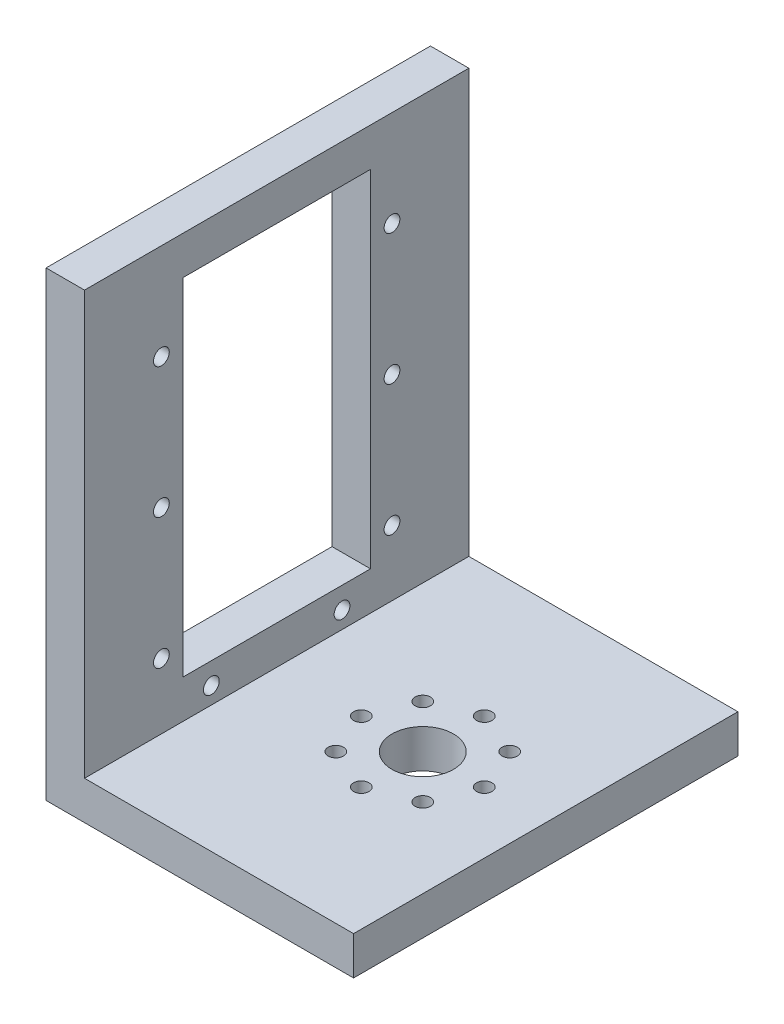
ISO-10303-21;
HEADER;
FILE_DESCRIPTION(('STEP AP214'),'2;1');
FILE_NAME('part.step','',(''),(''),'','','');
FILE_SCHEMA(('AUTOMOTIVE_DESIGN { 1 0 10303 214 1 1 1 1 }'));
ENDSEC;
DATA;
#1=APPLICATION_CONTEXT('core data for automotive mechanical design processes');
#2=APPLICATION_PROTOCOL_DEFINITION('international standard','automotive_design',2000,#1);
#3=PRODUCT_CONTEXT('',#1,'mechanical');
#4=PRODUCT('Part','Part','',(#3));
#5=PRODUCT_RELATED_PRODUCT_CATEGORY('part','',(#4));
#6=PRODUCT_DEFINITION_FORMATION('','',#4);
#7=PRODUCT_DEFINITION_CONTEXT('part definition',#1,'design');
#8=PRODUCT_DEFINITION('design','',#6,#7);
#9=PRODUCT_DEFINITION_SHAPE('','',#8);
#10=(LENGTH_UNIT() NAMED_UNIT(*) SI_UNIT(.MILLI.,.METRE.));
#11=(NAMED_UNIT(*) PLANE_ANGLE_UNIT() SI_UNIT($,.RADIAN.));
#12=(NAMED_UNIT(*) SI_UNIT($,.STERADIAN.) SOLID_ANGLE_UNIT());
#13=UNCERTAINTY_MEASURE_WITH_UNIT(LENGTH_MEASURE(1.E-05),#10,'distance_accuracy_value','');
#14=(GEOMETRIC_REPRESENTATION_CONTEXT(3) GLOBAL_UNCERTAINTY_ASSIGNED_CONTEXT((#13)) GLOBAL_UNIT_ASSIGNED_CONTEXT((#10,
#11,#12)) REPRESENTATION_CONTEXT('',''));
#15=CARTESIAN_POINT('',(0.,0.,0.));
#16=DIRECTION('',(0.,0.,1.));
#17=DIRECTION('',(1.,0.,0.));
#18=AXIS2_PLACEMENT_3D('',#15,#16,#17);
#19=CARTESIAN_POINT('',(0.,5.,0.));
#20=DIRECTION('',(0.,-1.,0.));
#21=DIRECTION('',(0.,0.,-1.));
#22=AXIS2_PLACEMENT_3D('',#19,#20,#21);
#23=PLANE('',#22);
#24=CARTESIAN_POINT('',(18.3431457505076,5.,-30.6568542494924));
#25=DIRECTION('',(0.,1.,0.));
#26=DIRECTION('',(0.,0.,1.));
#27=AXIS2_PLACEMENT_3D('',#24,#25,#26);
#28=CIRCLE('',#27,0.999999999999998);
#29=CARTESIAN_POINT('',(18.3431457505076,5.,-29.6568542494924));
#30=VERTEX_POINT('',#29);
#31=EDGE_CURVE('E168',#30,#30,#28,.T.);
#32=ORIENTED_EDGE('',*,*,#31,.F.);
#33=EDGE_LOOP('',(#32));
#34=FACE_BOUND('',#33,.T.);
#35=CARTESIAN_POINT('',(16.,5.,-25.));
#36=DIRECTION('',(0.,1.,0.));
#37=DIRECTION('',(0.,0.,1.));
#38=AXIS2_PLACEMENT_3D('',#35,#36,#37);
#39=CIRCLE('',#38,0.999999999999998);
#40=CARTESIAN_POINT('',(16.,5.,-24.));
#41=VERTEX_POINT('',#40);
#42=EDGE_CURVE('E174',#41,#41,#39,.T.);
#43=ORIENTED_EDGE('',*,*,#42,.F.);
#44=EDGE_LOOP('',(#43));
#45=FACE_BOUND('',#44,.T.);
#46=CARTESIAN_POINT('',(18.3431457505076,5.,-19.3431457505076));
#47=DIRECTION('',(0.,1.,0.));
#48=DIRECTION('',(0.,0.,1.));
#49=AXIS2_PLACEMENT_3D('',#46,#47,#48);
#50=CIRCLE('',#49,0.999999999999998);
#51=CARTESIAN_POINT('',(18.3431457505076,5.,-18.3431457505076));
#52=VERTEX_POINT('',#51);
#53=EDGE_CURVE('E180',#52,#52,#50,.T.);
#54=ORIENTED_EDGE('',*,*,#53,.F.);
#55=EDGE_LOOP('',(#54));
#56=FACE_BOUND('',#55,.T.);
#57=CARTESIAN_POINT('',(24.,5.,-17.));
#58=DIRECTION('',(0.,1.,0.));
#59=DIRECTION('',(0.,0.,1.));
#60=AXIS2_PLACEMENT_3D('',#57,#58,#59);
#61=CIRCLE('',#60,0.999999999999998);
#62=CARTESIAN_POINT('',(24.,5.,-16.));
#63=VERTEX_POINT('',#62);
#64=EDGE_CURVE('E186',#63,#63,#61,.T.);
#65=ORIENTED_EDGE('',*,*,#64,.F.);
#66=EDGE_LOOP('',(#65));
#67=FACE_BOUND('',#66,.T.);
#68=CARTESIAN_POINT('',(29.6568542494924,5.,-19.3431457505076));
#69=DIRECTION('',(0.,1.,0.));
#70=DIRECTION('',(0.,0.,1.));
#71=AXIS2_PLACEMENT_3D('',#68,#69,#70);
#72=CIRCLE('',#71,0.999999999999998);
#73=CARTESIAN_POINT('',(29.6568542494924,5.,-18.3431457505076));
#74=VERTEX_POINT('',#73);
#75=EDGE_CURVE('E192',#74,#74,#72,.T.);
#76=ORIENTED_EDGE('',*,*,#75,.F.);
#77=EDGE_LOOP('',(#76));
#78=FACE_BOUND('',#77,.T.);
#79=CARTESIAN_POINT('',(32.,5.,-25.));
#80=DIRECTION('',(0.,1.,0.));
#81=DIRECTION('',(0.,0.,1.));
#82=AXIS2_PLACEMENT_3D('',#79,#80,#81);
#83=CIRCLE('',#82,0.999999999999998);
#84=CARTESIAN_POINT('',(32.,5.,-24.));
#85=VERTEX_POINT('',#84);
#86=EDGE_CURVE('E198',#85,#85,#83,.T.);
#87=ORIENTED_EDGE('',*,*,#86,.F.);
#88=EDGE_LOOP('',(#87));
#89=FACE_BOUND('',#88,.T.);
#90=CARTESIAN_POINT('',(29.6568542494924,5.,-30.6568542494924));
#91=DIRECTION('',(0.,1.,0.));
#92=DIRECTION('',(0.,0.,1.));
#93=AXIS2_PLACEMENT_3D('',#90,#91,#92);
#94=CIRCLE('',#93,0.999999999999998);
#95=CARTESIAN_POINT('',(29.6568542494924,5.,-29.6568542494924));
#96=VERTEX_POINT('',#95);
#97=EDGE_CURVE('E204',#96,#96,#94,.T.);
#98=ORIENTED_EDGE('',*,*,#97,.F.);
#99=EDGE_LOOP('',(#98));
#100=FACE_BOUND('',#99,.T.);
#101=CARTESIAN_POINT('',(24.,5.,-33.));
#102=DIRECTION('',(0.,1.,0.));
#103=DIRECTION('',(0.,0.,1.));
#104=AXIS2_PLACEMENT_3D('',#101,#102,#103);
#105=CIRCLE('',#104,0.999999999999998);
#106=CARTESIAN_POINT('',(24.,5.,-32.));
#107=VERTEX_POINT('',#106);
#108=EDGE_CURVE('E210',#107,#107,#105,.T.);
#109=ORIENTED_EDGE('',*,*,#108,.F.);
#110=EDGE_LOOP('',(#109));
#111=FACE_BOUND('',#110,.T.);
#112=CARTESIAN_POINT('',(24.,5.,-25.));
#113=DIRECTION('',(0.,1.,0.));
#114=DIRECTION('',(0.,0.,1.));
#115=AXIS2_PLACEMENT_3D('',#112,#113,#114);
#116=CIRCLE('',#115,4.);
#117=CARTESIAN_POINT('',(24.,5.,-21.));
#118=VERTEX_POINT('',#117);
#119=EDGE_CURVE('E216',#118,#118,#116,.T.);
#120=ORIENTED_EDGE('',*,*,#119,.F.);
#121=EDGE_LOOP('',(#120));
#122=FACE_BOUND('',#121,.T.);
#123=DIRECTION('',(0.,0.,-1.));
#124=VECTOR('',#123,1.);
#125=CARTESIAN_POINT('',(5.,5.,0.));
#126=LINE('',#125,#124);
#127=CARTESIAN_POINT('',(5.,5.,0.));
#128=VERTEX_POINT('',#127);
#129=CARTESIAN_POINT('',(5.,5.,-50.));
#130=VERTEX_POINT('',#129);
#131=EDGE_CURVE('E164',#128,#130,#126,.T.);
#132=ORIENTED_EDGE('',*,*,#131,.F.);
#133=DIRECTION('',(1.,0.,0.));
#134=VECTOR('',#133,1.);
#135=CARTESIAN_POINT('',(0.,5.,0.));
#136=LINE('',#135,#134);
#137=CARTESIAN_POINT('',(40.,5.,0.));
#138=VERTEX_POINT('',#137);
#139=EDGE_CURVE('E222',#128,#138,#136,.T.);
#140=ORIENTED_EDGE('',*,*,#139,.T.);
#141=DIRECTION('',(0.,0.,-1.));
#142=VECTOR('',#141,1.);
#143=CARTESIAN_POINT('',(40.,5.,0.));
#144=LINE('',#143,#142);
#145=CARTESIAN_POINT('',(40.,5.,-50.));
#146=VERTEX_POINT('',#145);
#147=EDGE_CURVE('E224',#138,#146,#144,.T.);
#148=ORIENTED_EDGE('',*,*,#147,.T.);
#149=DIRECTION('',(-1.,0.,0.));
#150=VECTOR('',#149,1.);
#151=CARTESIAN_POINT('',(0.,5.,-50.));
#152=LINE('',#151,#150);
#153=EDGE_CURVE('E227',#146,#130,#152,.T.);
#154=ORIENTED_EDGE('',*,*,#153,.T.);
#155=EDGE_LOOP('',(#132,#140,#148,#154));
#156=FACE_BOUND('',#155,.T.);
#157=ADVANCED_FACE('F41',(#34,#45,#56,#67,#78,#89,#100,#111,#122,#156),#23,.F.);
#158=CARTESIAN_POINT('',(0.,0.,0.));
#159=DIRECTION('',(0.,-1.,0.));
#160=DIRECTION('',(0.,0.,-1.));
#161=AXIS2_PLACEMENT_3D('',#158,#159,#160);
#162=PLANE('',#161);
#163=DIRECTION('',(0.,0.,1.));
#164=VECTOR('',#163,1.);
#165=CARTESIAN_POINT('',(0.,0.,0.));
#166=LINE('',#165,#164);
#167=CARTESIAN_POINT('',(0.,0.,-50.));
#168=VERTEX_POINT('',#167);
#169=CARTESIAN_POINT('',(0.,0.,0.));
#170=VERTEX_POINT('',#169);
#171=EDGE_CURVE('E219',#168,#170,#166,.T.);
#172=ORIENTED_EDGE('',*,*,#171,.F.);
#173=DIRECTION('',(-1.,0.,0.));
#174=VECTOR('',#173,1.);
#175=CARTESIAN_POINT('',(0.,0.,-50.));
#176=LINE('',#175,#174);
#177=CARTESIAN_POINT('',(40.,0.,-50.));
#178=VERTEX_POINT('',#177);
#179=EDGE_CURVE('E225',#178,#168,#176,.T.);
#180=ORIENTED_EDGE('',*,*,#179,.F.);
#181=DIRECTION('',(0.,0.,-1.));
#182=VECTOR('',#181,1.);
#183=CARTESIAN_POINT('',(40.,0.,0.));
#184=LINE('',#183,#182);
#185=CARTESIAN_POINT('',(40.,0.,0.));
#186=VERTEX_POINT('',#185);
#187=EDGE_CURVE('E234',#186,#178,#184,.T.);
#188=ORIENTED_EDGE('',*,*,#187,.F.);
#189=DIRECTION('',(1.,0.,0.));
#190=VECTOR('',#189,1.);
#191=CARTESIAN_POINT('',(0.,0.,0.));
#192=LINE('',#191,#190);
#193=EDGE_CURVE('E232',#170,#186,#192,.T.);
#194=ORIENTED_EDGE('',*,*,#193,.F.);
#195=EDGE_LOOP('',(#172,#180,#188,#194));
#196=FACE_BOUND('',#195,.T.);
#197=CARTESIAN_POINT('',(16.,0.,-25.));
#198=DIRECTION('',(0.,1.,0.));
#199=DIRECTION('',(0.,0.,1.));
#200=AXIS2_PLACEMENT_3D('',#197,#198,#199);
#201=CIRCLE('',#200,0.999999999999998);
#202=CARTESIAN_POINT('',(16.,0.,-24.));
#203=VERTEX_POINT('',#202);
#204=EDGE_CURVE('E171',#203,#203,#201,.T.);
#205=ORIENTED_EDGE('',*,*,#204,.T.);
#206=EDGE_LOOP('',(#205));
#207=FACE_BOUND('',#206,.T.);
#208=CARTESIAN_POINT('',(24.,0.,-17.));
#209=DIRECTION('',(0.,1.,0.));
#210=DIRECTION('',(0.,0.,1.));
#211=AXIS2_PLACEMENT_3D('',#208,#209,#210);
#212=CIRCLE('',#211,0.999999999999998);
#213=CARTESIAN_POINT('',(24.,0.,-16.));
#214=VERTEX_POINT('',#213);
#215=EDGE_CURVE('E183',#214,#214,#212,.T.);
#216=ORIENTED_EDGE('',*,*,#215,.T.);
#217=EDGE_LOOP('',(#216));
#218=FACE_BOUND('',#217,.T.);
#219=CARTESIAN_POINT('',(32.,0.,-25.));
#220=DIRECTION('',(0.,1.,0.));
#221=DIRECTION('',(0.,0.,1.));
#222=AXIS2_PLACEMENT_3D('',#219,#220,#221);
#223=CIRCLE('',#222,0.999999999999998);
#224=CARTESIAN_POINT('',(32.,0.,-24.));
#225=VERTEX_POINT('',#224);
#226=EDGE_CURVE('E195',#225,#225,#223,.T.);
#227=ORIENTED_EDGE('',*,*,#226,.T.);
#228=EDGE_LOOP('',(#227));
#229=FACE_BOUND('',#228,.T.);
#230=CARTESIAN_POINT('',(24.,0.,-33.));
#231=DIRECTION('',(0.,1.,0.));
#232=DIRECTION('',(0.,0.,1.));
#233=AXIS2_PLACEMENT_3D('',#230,#231,#232);
#234=CIRCLE('',#233,0.999999999999998);
#235=CARTESIAN_POINT('',(24.,0.,-32.));
#236=VERTEX_POINT('',#235);
#237=EDGE_CURVE('E207',#236,#236,#234,.T.);
#238=ORIENTED_EDGE('',*,*,#237,.T.);
#239=EDGE_LOOP('',(#238));
#240=FACE_BOUND('',#239,.T.);
#241=CARTESIAN_POINT('',(24.,0.,-25.));
#242=DIRECTION('',(0.,1.,0.));
#243=DIRECTION('',(0.,0.,1.));
#244=AXIS2_PLACEMENT_3D('',#241,#242,#243);
#245=CIRCLE('',#244,4.);
#246=CARTESIAN_POINT('',(24.,0.,-21.));
#247=VERTEX_POINT('',#246);
#248=EDGE_CURVE('E213',#247,#247,#245,.T.);
#249=ORIENTED_EDGE('',*,*,#248,.T.);
#250=EDGE_LOOP('',(#249));
#251=FACE_BOUND('',#250,.T.);
#252=CARTESIAN_POINT('',(29.6568542494924,0.,-30.6568542494924));
#253=DIRECTION('',(0.,1.,0.));
#254=DIRECTION('',(0.,0.,1.));
#255=AXIS2_PLACEMENT_3D('',#252,#253,#254);
#256=CIRCLE('',#255,0.999999999999998);
#257=CARTESIAN_POINT('',(29.6568542494924,0.,-29.6568542494924));
#258=VERTEX_POINT('',#257);
#259=EDGE_CURVE('E201',#258,#258,#256,.T.);
#260=ORIENTED_EDGE('',*,*,#259,.T.);
#261=EDGE_LOOP('',(#260));
#262=FACE_BOUND('',#261,.T.);
#263=CARTESIAN_POINT('',(29.6568542494924,0.,-19.3431457505076));
#264=DIRECTION('',(0.,1.,0.));
#265=DIRECTION('',(0.,0.,1.));
#266=AXIS2_PLACEMENT_3D('',#263,#264,#265);
#267=CIRCLE('',#266,0.999999999999998);
#268=CARTESIAN_POINT('',(29.6568542494924,0.,-18.3431457505076));
#269=VERTEX_POINT('',#268);
#270=EDGE_CURVE('E189',#269,#269,#267,.T.);
#271=ORIENTED_EDGE('',*,*,#270,.T.);
#272=EDGE_LOOP('',(#271));
#273=FACE_BOUND('',#272,.T.);
#274=CARTESIAN_POINT('',(18.3431457505076,0.,-19.3431457505076));
#275=DIRECTION('',(0.,1.,0.));
#276=DIRECTION('',(0.,0.,1.));
#277=AXIS2_PLACEMENT_3D('',#274,#275,#276);
#278=CIRCLE('',#277,0.999999999999998);
#279=CARTESIAN_POINT('',(18.3431457505076,0.,-18.3431457505076));
#280=VERTEX_POINT('',#279);
#281=EDGE_CURVE('E177',#280,#280,#278,.T.);
#282=ORIENTED_EDGE('',*,*,#281,.T.);
#283=EDGE_LOOP('',(#282));
#284=FACE_BOUND('',#283,.T.);
#285=CARTESIAN_POINT('',(18.3431457505076,0.,-30.6568542494924));
#286=DIRECTION('',(0.,1.,0.));
#287=DIRECTION('',(0.,0.,1.));
#288=AXIS2_PLACEMENT_3D('',#285,#286,#287);
#289=CIRCLE('',#288,0.999999999999998);
#290=CARTESIAN_POINT('',(18.3431457505076,0.,-29.6568542494924));
#291=VERTEX_POINT('',#290);
#292=EDGE_CURVE('E167',#291,#291,#289,.T.);
#293=ORIENTED_EDGE('',*,*,#292,.T.);
#294=EDGE_LOOP('',(#293));
#295=FACE_BOUND('',#294,.T.);
#296=ADVANCED_FACE('F292',(#196,#207,#218,#229,#240,#251,#262,#273,#284,#295),#162,.T.);
#297=CARTESIAN_POINT('',(0.,5.,0.));
#298=DIRECTION('',(1.,0.,0.));
#299=DIRECTION('',(0.,0.,-1.));
#300=AXIS2_PLACEMENT_3D('',#297,#298,#299);
#301=PLANE('',#300);
#302=CARTESIAN_POINT('',(0.,47.5,-40.));
#303=DIRECTION('',(-1.,0.,0.));
#304=DIRECTION('',(0.,0.,1.));
#305=AXIS2_PLACEMENT_3D('',#302,#303,#304);
#306=CIRCLE('',#305,1.025);
#307=CARTESIAN_POINT('',(0.,47.5,-38.975));
#308=VERTEX_POINT('',#307);
#309=EDGE_CURVE('E617',#308,#308,#306,.T.);
#310=ORIENTED_EDGE('',*,*,#309,.F.);
#311=EDGE_LOOP('',(#310));
#312=FACE_BOUND('',#311,.T.);
#313=CARTESIAN_POINT('',(0.,47.5,-10.));
#314=DIRECTION('',(-1.,0.,0.));
#315=DIRECTION('',(0.,0.,1.));
#316=AXIS2_PLACEMENT_3D('',#313,#314,#315);
#317=CIRCLE('',#316,1.025);
#318=CARTESIAN_POINT('',(0.,47.5,-8.975));
#319=VERTEX_POINT('',#318);
#320=EDGE_CURVE('E618',#319,#319,#317,.T.);
#321=ORIENTED_EDGE('',*,*,#320,.F.);
#322=EDGE_LOOP('',(#321));
#323=FACE_BOUND('',#322,.T.);
#324=CARTESIAN_POINT('',(0.,13.5,-40.));
#325=DIRECTION('',(-1.,0.,0.));
#326=DIRECTION('',(0.,0.,1.));
#327=AXIS2_PLACEMENT_3D('',#324,#325,#326);
#328=CIRCLE('',#327,1.025);
#329=CARTESIAN_POINT('',(0.,13.5,-38.975));
#330=VERTEX_POINT('',#329);
#331=EDGE_CURVE('E602',#330,#330,#328,.T.);
#332=ORIENTED_EDGE('',*,*,#331,.F.);
#333=EDGE_LOOP('',(#332));
#334=FACE_BOUND('',#333,.T.);
#335=CARTESIAN_POINT('',(0.,30.5,-40.));
#336=DIRECTION('',(-1.,0.,0.));
#337=DIRECTION('',(0.,0.,1.));
#338=AXIS2_PLACEMENT_3D('',#335,#336,#337);
#339=CIRCLE('',#338,1.025);
#340=CARTESIAN_POINT('',(0.,30.5,-38.975));
#341=VERTEX_POINT('',#340);
#342=EDGE_CURVE('E621',#341,#341,#339,.T.);
#343=ORIENTED_EDGE('',*,*,#342,.F.);
#344=EDGE_LOOP('',(#343));
#345=FACE_BOUND('',#344,.T.);
#346=CARTESIAN_POINT('',(0.,7.19999999999999,-33.5));
#347=DIRECTION('',(-1.,0.,0.));
#348=DIRECTION('',(0.,0.,1.));
#349=AXIS2_PLACEMENT_3D('',#346,#347,#348);
#350=CIRCLE('',#349,1.025);
#351=CARTESIAN_POINT('',(0.,7.19999999999999,-32.475));
#352=VERTEX_POINT('',#351);
#353=EDGE_CURVE('E624',#352,#352,#350,.T.);
#354=ORIENTED_EDGE('',*,*,#353,.F.);
#355=EDGE_LOOP('',(#354));
#356=FACE_BOUND('',#355,.T.);
#357=CARTESIAN_POINT('',(0.,7.19999999999999,-16.5));
#358=DIRECTION('',(-1.,0.,0.));
#359=DIRECTION('',(0.,0.,-1.));
#360=AXIS2_PLACEMENT_3D('',#357,#358,#359);
#361=CIRCLE('',#360,1.025);
#362=CARTESIAN_POINT('',(0.,7.19999999999999,-17.525));
#363=VERTEX_POINT('',#362);
#364=EDGE_CURVE('E634',#363,#363,#361,.T.);
#365=ORIENTED_EDGE('',*,*,#364,.F.);
#366=EDGE_LOOP('',(#365));
#367=FACE_BOUND('',#366,.T.);
#368=CARTESIAN_POINT('',(0.,30.5,-10.));
#369=DIRECTION('',(-1.,0.,0.));
#370=DIRECTION('',(0.,0.,1.));
#371=AXIS2_PLACEMENT_3D('',#368,#369,#370);
#372=CIRCLE('',#371,1.025);
#373=CARTESIAN_POINT('',(0.,30.5,-8.975));
#374=VERTEX_POINT('',#373);
#375=EDGE_CURVE('E631',#374,#374,#372,.T.);
#376=ORIENTED_EDGE('',*,*,#375,.F.);
#377=EDGE_LOOP('',(#376));
#378=FACE_BOUND('',#377,.T.);
#379=CARTESIAN_POINT('',(0.,13.5,-9.99999999999999));
#380=DIRECTION('',(-1.,0.,0.));
#381=DIRECTION('',(0.,0.,-1.));
#382=AXIS2_PLACEMENT_3D('',#379,#380,#381);
#383=CIRCLE('',#382,1.025);
#384=CARTESIAN_POINT('',(0.,13.5,-11.025));
#385=VERTEX_POINT('',#384);
#386=EDGE_CURVE('E628',#385,#385,#383,.T.);
#387=ORIENTED_EDGE('',*,*,#386,.F.);
#388=EDGE_LOOP('',(#387));
#389=FACE_BOUND('',#388,.T.);
#390=DIRECTION('',(0.,0.,1.));
#391=VECTOR('',#390,1.);
#392=CARTESIAN_POINT('',(0.,10.,-37.2));
#393=LINE('',#392,#391);
#394=CARTESIAN_POINT('',(0.,10.,-37.2));
#395=VERTEX_POINT('',#394);
#396=CARTESIAN_POINT('',(0.,10.,-12.8));
#397=VERTEX_POINT('',#396);
#398=EDGE_CURVE('E132',#395,#397,#393,.T.);
#399=ORIENTED_EDGE('',*,*,#398,.F.);
#400=DIRECTION('',(0.,-1.,0.));
#401=VECTOR('',#400,1.);
#402=CARTESIAN_POINT('',(0.,10.,-37.2));
#403=LINE('',#402,#401);
#404=CARTESIAN_POINT('',(0.,55.,-37.2));
#405=VERTEX_POINT('',#404);
#406=EDGE_CURVE('E58',#405,#395,#403,.T.);
#407=ORIENTED_EDGE('',*,*,#406,.F.);
#408=DIRECTION('',(0.,0.,-1.));
#409=VECTOR('',#408,1.);
#410=CARTESIAN_POINT('',(0.,55.,-37.2));
#411=LINE('',#410,#409);
#412=CARTESIAN_POINT('',(0.,55.,-12.8));
#413=VERTEX_POINT('',#412);
#414=EDGE_CURVE('E138',#413,#405,#411,.T.);
#415=ORIENTED_EDGE('',*,*,#414,.F.);
#416=DIRECTION('',(0.,1.,0.));
#417=VECTOR('',#416,1.);
#418=CARTESIAN_POINT('',(0.,10.,-12.8));
#419=LINE('',#418,#417);
#420=EDGE_CURVE('E123',#397,#413,#419,.T.);
#421=ORIENTED_EDGE('',*,*,#420,.F.);
#422=EDGE_LOOP('',(#399,#407,#415,#421));
#423=FACE_BOUND('',#422,.T.);
#424=ORIENTED_EDGE('',*,*,#171,.T.);
#425=DIRECTION('',(0.,-1.,0.));
#426=VECTOR('',#425,1.);
#427=CARTESIAN_POINT('',(0.,5.,0.));
#428=LINE('',#427,#426);
#429=CARTESIAN_POINT('',(0.,60.,0.));
#430=VERTEX_POINT('',#429);
#431=EDGE_CURVE('E245',#430,#170,#428,.T.);
#432=ORIENTED_EDGE('',*,*,#431,.F.);
#433=DIRECTION('',(0.,0.,1.));
#434=VECTOR('',#433,1.);
#435=CARTESIAN_POINT('',(0.,60.,0.));
#436=LINE('',#435,#434);
#437=CARTESIAN_POINT('',(0.,60.,-50.));
#438=VERTEX_POINT('',#437);
#439=EDGE_CURVE('E148',#438,#430,#436,.T.);
#440=ORIENTED_EDGE('',*,*,#439,.F.);
#441=DIRECTION('',(0.,-1.,0.));
#442=VECTOR('',#441,1.);
#443=CARTESIAN_POINT('',(0.,5.,-50.));
#444=LINE('',#443,#442);
#445=EDGE_CURVE('E229',#438,#168,#444,.T.);
#446=ORIENTED_EDGE('',*,*,#445,.T.);
#447=EDGE_LOOP('',(#424,#432,#440,#446));
#448=FACE_BOUND('',#447,.T.);
#449=ADVANCED_FACE('F43',(#312,#323,#334,#345,#356,#367,#378,#389,#423,#448),#301,.F.);
#450=CARTESIAN_POINT('',(0.,5.,0.));
#451=DIRECTION('',(0.,0.,-1.));
#452=DIRECTION('',(-1.,0.,0.));
#453=AXIS2_PLACEMENT_3D('',#450,#451,#452);
#454=PLANE('',#453);
#455=ORIENTED_EDGE('',*,*,#193,.T.);
#456=DIRECTION('',(0.,-1.,0.));
#457=VECTOR('',#456,1.);
#458=CARTESIAN_POINT('',(40.,5.,0.));
#459=LINE('',#458,#457);
#460=EDGE_CURVE('E242',#138,#186,#459,.T.);
#461=ORIENTED_EDGE('',*,*,#460,.F.);
#462=ORIENTED_EDGE('',*,*,#139,.F.);
#463=DIRECTION('',(0.,-1.,0.));
#464=VECTOR('',#463,1.);
#465=CARTESIAN_POINT('',(5.,60.,0.));
#466=LINE('',#465,#464);
#467=CARTESIAN_POINT('',(5.,60.,0.));
#468=VERTEX_POINT('',#467);
#469=EDGE_CURVE('E161',#468,#128,#466,.T.);
#470=ORIENTED_EDGE('',*,*,#469,.F.);
#471=DIRECTION('',(1.,0.,0.));
#472=VECTOR('',#471,1.);
#473=CARTESIAN_POINT('',(0.,60.,0.));
#474=LINE('',#473,#472);
#475=EDGE_CURVE('E151',#430,#468,#474,.T.);
#476=ORIENTED_EDGE('',*,*,#475,.F.);
#477=ORIENTED_EDGE('',*,*,#431,.T.);
#478=EDGE_LOOP('',(#455,#461,#462,#470,#476,#477));
#479=FACE_BOUND('',#478,.T.);
#480=ADVANCED_FACE('F312',(#479),#454,.F.);
#481=CARTESIAN_POINT('',(40.,5.,0.));
#482=DIRECTION('',(-1.,0.,0.));
#483=DIRECTION('',(0.,0.,1.));
#484=AXIS2_PLACEMENT_3D('',#481,#482,#483);
#485=PLANE('',#484);
#486=ORIENTED_EDGE('',*,*,#187,.T.);
#487=DIRECTION('',(0.,-1.,0.));
#488=VECTOR('',#487,1.);
#489=CARTESIAN_POINT('',(40.,5.,-50.));
#490=LINE('',#489,#488);
#491=EDGE_CURVE('E239',#146,#178,#490,.T.);
#492=ORIENTED_EDGE('',*,*,#491,.F.);
#493=ORIENTED_EDGE('',*,*,#147,.F.);
#494=ORIENTED_EDGE('',*,*,#460,.T.);
#495=EDGE_LOOP('',(#486,#492,#493,#494));
#496=FACE_BOUND('',#495,.T.);
#497=ADVANCED_FACE('F309',(#496),#485,.F.);
#498=CARTESIAN_POINT('',(0.,5.,-50.));
#499=DIRECTION('',(0.,0.,1.));
#500=DIRECTION('',(1.,0.,0.));
#501=AXIS2_PLACEMENT_3D('',#498,#499,#500);
#502=PLANE('',#501);
#503=ORIENTED_EDGE('',*,*,#445,.F.);
#504=DIRECTION('',(-1.,0.,0.));
#505=VECTOR('',#504,1.);
#506=CARTESIAN_POINT('',(0.,60.,-50.));
#507=LINE('',#506,#505);
#508=CARTESIAN_POINT('',(5.,60.,-50.));
#509=VERTEX_POINT('',#508);
#510=EDGE_CURVE('E155',#509,#438,#507,.T.);
#511=ORIENTED_EDGE('',*,*,#510,.F.);
#512=DIRECTION('',(0.,-1.,0.));
#513=VECTOR('',#512,1.);
#514=CARTESIAN_POINT('',(5.,60.,-50.));
#515=LINE('',#514,#513);
#516=EDGE_CURVE('E158',#509,#130,#515,.T.);
#517=ORIENTED_EDGE('',*,*,#516,.T.);
#518=ORIENTED_EDGE('',*,*,#153,.F.);
#519=ORIENTED_EDGE('',*,*,#491,.T.);
#520=ORIENTED_EDGE('',*,*,#179,.T.);
#521=EDGE_LOOP('',(#503,#511,#517,#518,#519,#520));
#522=FACE_BOUND('',#521,.T.);
#523=ADVANCED_FACE('F306',(#522),#502,.F.);
#524=CARTESIAN_POINT('',(24.,5.,-25.));
#525=DIRECTION('',(0.,-1.,0.));
#526=DIRECTION('',(0.,0.,-1.));
#527=AXIS2_PLACEMENT_3D('',#524,#525,#526);
#528=CYLINDRICAL_SURFACE('',#527,4.);
#529=ORIENTED_EDGE('',*,*,#119,.T.);
#530=EDGE_LOOP('',(#529));
#531=FACE_BOUND('',#530,.T.);
#532=ORIENTED_EDGE('',*,*,#248,.F.);
#533=EDGE_LOOP('',(#532));
#534=FACE_BOUND('',#533,.T.);
#535=ADVANCED_FACE('F303',(#531,#534),#528,.F.);
#536=CARTESIAN_POINT('',(24.,5.,-33.));
#537=DIRECTION('',(0.,-1.,0.));
#538=DIRECTION('',(0.,0.,-1.));
#539=AXIS2_PLACEMENT_3D('',#536,#537,#538);
#540=CYLINDRICAL_SURFACE('',#539,0.999999999999998);
#541=ORIENTED_EDGE('',*,*,#108,.T.);
#542=EDGE_LOOP('',(#541));
#543=FACE_BOUND('',#542,.T.);
#544=ORIENTED_EDGE('',*,*,#237,.F.);
#545=EDGE_LOOP('',(#544));
#546=FACE_BOUND('',#545,.T.);
#547=ADVANCED_FACE('F374',(#543,#546),#540,.F.);
#548=CARTESIAN_POINT('',(29.6568542494924,5.,-30.6568542494924));
#549=DIRECTION('',(0.,-1.,0.));
#550=DIRECTION('',(0.,0.,-1.));
#551=AXIS2_PLACEMENT_3D('',#548,#549,#550);
#552=CYLINDRICAL_SURFACE('',#551,0.999999999999998);
#553=ORIENTED_EDGE('',*,*,#97,.T.);
#554=EDGE_LOOP('',(#553));
#555=FACE_BOUND('',#554,.T.);
#556=ORIENTED_EDGE('',*,*,#259,.F.);
#557=EDGE_LOOP('',(#556));
#558=FACE_BOUND('',#557,.T.);
#559=ADVANCED_FACE('F371',(#555,#558),#552,.F.);
#560=CARTESIAN_POINT('',(32.,5.,-25.));
#561=DIRECTION('',(0.,-1.,0.));
#562=DIRECTION('',(0.,0.,-1.));
#563=AXIS2_PLACEMENT_3D('',#560,#561,#562);
#564=CYLINDRICAL_SURFACE('',#563,0.999999999999998);
#565=ORIENTED_EDGE('',*,*,#86,.T.);
#566=EDGE_LOOP('',(#565));
#567=FACE_BOUND('',#566,.T.);
#568=ORIENTED_EDGE('',*,*,#226,.F.);
#569=EDGE_LOOP('',(#568));
#570=FACE_BOUND('',#569,.T.);
#571=ADVANCED_FACE('F367',(#567,#570),#564,.F.);
#572=CARTESIAN_POINT('',(29.6568542494924,5.,-19.3431457505076));
#573=DIRECTION('',(0.,-1.,0.));
#574=DIRECTION('',(0.,0.,-1.));
#575=AXIS2_PLACEMENT_3D('',#572,#573,#574);
#576=CYLINDRICAL_SURFACE('',#575,0.999999999999998);
#577=ORIENTED_EDGE('',*,*,#75,.T.);
#578=EDGE_LOOP('',(#577));
#579=FACE_BOUND('',#578,.T.);
#580=ORIENTED_EDGE('',*,*,#270,.F.);
#581=EDGE_LOOP('',(#580));
#582=FACE_BOUND('',#581,.T.);
#583=ADVANCED_FACE('F363',(#579,#582),#576,.F.);
#584=CARTESIAN_POINT('',(24.,5.,-17.));
#585=DIRECTION('',(0.,-1.,0.));
#586=DIRECTION('',(0.,0.,-1.));
#587=AXIS2_PLACEMENT_3D('',#584,#585,#586);
#588=CYLINDRICAL_SURFACE('',#587,0.999999999999998);
#589=ORIENTED_EDGE('',*,*,#64,.T.);
#590=EDGE_LOOP('',(#589));
#591=FACE_BOUND('',#590,.T.);
#592=ORIENTED_EDGE('',*,*,#215,.F.);
#593=EDGE_LOOP('',(#592));
#594=FACE_BOUND('',#593,.T.);
#595=ADVANCED_FACE('F359',(#591,#594),#588,.F.);
#596=CARTESIAN_POINT('',(18.3431457505076,5.,-19.3431457505076));
#597=DIRECTION('',(0.,-1.,0.));
#598=DIRECTION('',(0.,0.,-1.));
#599=AXIS2_PLACEMENT_3D('',#596,#597,#598);
#600=CYLINDRICAL_SURFACE('',#599,0.999999999999998);
#601=ORIENTED_EDGE('',*,*,#53,.T.);
#602=EDGE_LOOP('',(#601));
#603=FACE_BOUND('',#602,.T.);
#604=ORIENTED_EDGE('',*,*,#281,.F.);
#605=EDGE_LOOP('',(#604));
#606=FACE_BOUND('',#605,.T.);
#607=ADVANCED_FACE('F355',(#603,#606),#600,.F.);
#608=CARTESIAN_POINT('',(16.,5.,-25.));
#609=DIRECTION('',(0.,-1.,0.));
#610=DIRECTION('',(0.,0.,-1.));
#611=AXIS2_PLACEMENT_3D('',#608,#609,#610);
#612=CYLINDRICAL_SURFACE('',#611,0.999999999999998);
#613=ORIENTED_EDGE('',*,*,#42,.T.);
#614=EDGE_LOOP('',(#613));
#615=FACE_BOUND('',#614,.T.);
#616=ORIENTED_EDGE('',*,*,#204,.F.);
#617=EDGE_LOOP('',(#616));
#618=FACE_BOUND('',#617,.T.);
#619=ADVANCED_FACE('F348',(#615,#618),#612,.F.);
#620=CARTESIAN_POINT('',(18.3431457505076,5.,-30.6568542494924));
#621=DIRECTION('',(0.,-1.,0.));
#622=DIRECTION('',(0.,0.,-1.));
#623=AXIS2_PLACEMENT_3D('',#620,#621,#622);
#624=CYLINDRICAL_SURFACE('',#623,0.999999999999998);
#625=ORIENTED_EDGE('',*,*,#31,.T.);
#626=EDGE_LOOP('',(#625));
#627=FACE_BOUND('',#626,.T.);
#628=ORIENTED_EDGE('',*,*,#292,.F.);
#629=EDGE_LOOP('',(#628));
#630=FACE_BOUND('',#629,.T.);
#631=ADVANCED_FACE('F340',(#627,#630),#624,.F.);
#632=CARTESIAN_POINT('',(5.,60.,0.));
#633=DIRECTION('',(-1.,0.,0.));
#634=DIRECTION('',(0.,0.,1.));
#635=AXIS2_PLACEMENT_3D('',#632,#633,#634);
#636=PLANE('',#635);
#637=CARTESIAN_POINT('',(5.,47.5,-40.));
#638=DIRECTION('',(-1.,0.,0.));
#639=DIRECTION('',(0.,0.,1.));
#640=AXIS2_PLACEMENT_3D('',#637,#638,#639);
#641=CIRCLE('',#640,1.025);
#642=CARTESIAN_POINT('',(5.,47.5,-38.975));
#643=VERTEX_POINT('',#642);
#644=EDGE_CURVE('E45',#643,#643,#641,.T.);
#645=ORIENTED_EDGE('',*,*,#644,.T.);
#646=EDGE_LOOP('',(#645));
#647=FACE_BOUND('',#646,.T.);
#648=CARTESIAN_POINT('',(5.,47.5,-10.));
#649=DIRECTION('',(-1.,0.,0.));
#650=DIRECTION('',(0.,0.,1.));
#651=AXIS2_PLACEMENT_3D('',#648,#649,#650);
#652=CIRCLE('',#651,1.025);
#653=CARTESIAN_POINT('',(5.,47.5,-8.975));
#654=VERTEX_POINT('',#653);
#655=EDGE_CURVE('E269',#654,#654,#652,.T.);
#656=ORIENTED_EDGE('',*,*,#655,.T.);
#657=EDGE_LOOP('',(#656));
#658=FACE_BOUND('',#657,.T.);
#659=CARTESIAN_POINT('',(5.,13.5,-40.));
#660=DIRECTION('',(-1.,0.,0.));
#661=DIRECTION('',(0.,0.,1.));
#662=AXIS2_PLACEMENT_3D('',#659,#660,#661);
#663=CIRCLE('',#662,1.025);
#664=CARTESIAN_POINT('',(5.,13.5,-38.975));
#665=VERTEX_POINT('',#664);
#666=EDGE_CURVE('E267',#665,#665,#663,.T.);
#667=ORIENTED_EDGE('',*,*,#666,.T.);
#668=EDGE_LOOP('',(#667));
#669=FACE_BOUND('',#668,.T.);
#670=CARTESIAN_POINT('',(5.,30.5,-40.));
#671=DIRECTION('',(-1.,0.,0.));
#672=DIRECTION('',(0.,0.,1.));
#673=AXIS2_PLACEMENT_3D('',#670,#671,#672);
#674=CIRCLE('',#673,1.025);
#675=CARTESIAN_POINT('',(5.,30.5,-38.975));
#676=VERTEX_POINT('',#675);
#677=EDGE_CURVE('E264',#676,#676,#674,.T.);
#678=ORIENTED_EDGE('',*,*,#677,.T.);
#679=EDGE_LOOP('',(#678));
#680=FACE_BOUND('',#679,.T.);
#681=CARTESIAN_POINT('',(5.,7.19999999999999,-33.5));
#682=DIRECTION('',(-1.,0.,0.));
#683=DIRECTION('',(0.,0.,1.));
#684=AXIS2_PLACEMENT_3D('',#681,#682,#683);
#685=CIRCLE('',#684,1.025);
#686=CARTESIAN_POINT('',(5.,7.19999999999999,-32.475));
#687=VERTEX_POINT('',#686);
#688=EDGE_CURVE('E261',#687,#687,#685,.T.);
#689=ORIENTED_EDGE('',*,*,#688,.T.);
#690=EDGE_LOOP('',(#689));
#691=FACE_BOUND('',#690,.T.);
#692=CARTESIAN_POINT('',(5.,7.19999999999999,-16.5));
#693=DIRECTION('',(-1.,0.,0.));
#694=DIRECTION('',(0.,0.,1.));
#695=AXIS2_PLACEMENT_3D('',#692,#693,#694);
#696=CIRCLE('',#695,1.025);
#697=CARTESIAN_POINT('',(5.,7.19999999999999,-15.475));
#698=VERTEX_POINT('',#697);
#699=EDGE_CURVE('E258',#698,#698,#696,.T.);
#700=ORIENTED_EDGE('',*,*,#699,.T.);
#701=EDGE_LOOP('',(#700));
#702=FACE_BOUND('',#701,.T.);
#703=CARTESIAN_POINT('',(5.,30.5,-10.));
#704=DIRECTION('',(-1.,0.,0.));
#705=DIRECTION('',(0.,0.,1.));
#706=AXIS2_PLACEMENT_3D('',#703,#704,#705);
#707=CIRCLE('',#706,1.025);
#708=CARTESIAN_POINT('',(5.,30.5,-8.975));
#709=VERTEX_POINT('',#708);
#710=EDGE_CURVE('E255',#709,#709,#707,.T.);
#711=ORIENTED_EDGE('',*,*,#710,.T.);
#712=EDGE_LOOP('',(#711));
#713=FACE_BOUND('',#712,.T.);
#714=CARTESIAN_POINT('',(5.,13.5,-9.99999999999999));
#715=DIRECTION('',(-1.,0.,0.));
#716=DIRECTION('',(0.,0.,1.));
#717=AXIS2_PLACEMENT_3D('',#714,#715,#716);
#718=CIRCLE('',#717,1.025);
#719=CARTESIAN_POINT('',(5.,13.5,-8.975));
#720=VERTEX_POINT('',#719);
#721=EDGE_CURVE('E145',#720,#720,#718,.T.);
#722=ORIENTED_EDGE('',*,*,#721,.T.);
#723=EDGE_LOOP('',(#722));
#724=FACE_BOUND('',#723,.T.);
#725=DIRECTION('',(0.,0.,-1.));
#726=VECTOR('',#725,1.);
#727=CARTESIAN_POINT('',(5.,55.,0.));
#728=LINE('',#727,#726);
#729=CARTESIAN_POINT('',(5.,55.,-12.8));
#730=VERTEX_POINT('',#729);
#731=CARTESIAN_POINT('',(5.,55.,-37.2));
#732=VERTEX_POINT('',#731);
#733=EDGE_CURVE('E50',#730,#732,#728,.T.);
#734=ORIENTED_EDGE('',*,*,#733,.T.);
#735=DIRECTION('',(0.,-1.,0.));
#736=VECTOR('',#735,1.);
#737=CARTESIAN_POINT('',(5.,60.,-37.2));
#738=LINE('',#737,#736);
#739=CARTESIAN_POINT('',(5.,10.,-37.2));
#740=VERTEX_POINT('',#739);
#741=EDGE_CURVE('E11',#732,#740,#738,.T.);
#742=ORIENTED_EDGE('',*,*,#741,.T.);
#743=DIRECTION('',(0.,0.,1.));
#744=VECTOR('',#743,1.);
#745=CARTESIAN_POINT('',(5.,10.,0.));
#746=LINE('',#745,#744);
#747=CARTESIAN_POINT('',(5.,10.,-12.8));
#748=VERTEX_POINT('',#747);
#749=EDGE_CURVE('E248',#740,#748,#746,.T.);
#750=ORIENTED_EDGE('',*,*,#749,.T.);
#751=DIRECTION('',(0.,1.,0.));
#752=VECTOR('',#751,1.);
#753=CARTESIAN_POINT('',(5.,60.,-12.8));
#754=LINE('',#753,#752);
#755=EDGE_CURVE('E126',#748,#730,#754,.T.);
#756=ORIENTED_EDGE('',*,*,#755,.T.);
#757=EDGE_LOOP('',(#734,#742,#750,#756));
#758=FACE_BOUND('',#757,.T.);
#759=ORIENTED_EDGE('',*,*,#469,.T.);
#760=ORIENTED_EDGE('',*,*,#131,.T.);
#761=ORIENTED_EDGE('',*,*,#516,.F.);
#762=DIRECTION('',(0.,0.,-1.));
#763=VECTOR('',#762,1.);
#764=CARTESIAN_POINT('',(5.,60.,0.));
#765=LINE('',#764,#763);
#766=EDGE_CURVE('E153',#468,#509,#765,.T.);
#767=ORIENTED_EDGE('',*,*,#766,.F.);
#768=EDGE_LOOP('',(#759,#760,#761,#767));
#769=FACE_BOUND('',#768,.T.);
#770=ADVANCED_FACE('F276',(#647,#658,#669,#680,#691,#702,#713,#724,#758,#769),#636,.F.);
#771=CARTESIAN_POINT('',(0.,60.,0.));
#772=DIRECTION('',(0.,-1.,0.));
#773=DIRECTION('',(0.,0.,-1.));
#774=AXIS2_PLACEMENT_3D('',#771,#772,#773);
#775=PLANE('',#774);
#776=ORIENTED_EDGE('',*,*,#439,.T.);
#777=ORIENTED_EDGE('',*,*,#475,.T.);
#778=ORIENTED_EDGE('',*,*,#766,.T.);
#779=ORIENTED_EDGE('',*,*,#510,.T.);
#780=EDGE_LOOP('',(#776,#777,#778,#779));
#781=FACE_BOUND('',#780,.T.);
#782=ADVANCED_FACE('F333',(#781),#775,.F.);
#783=CARTESIAN_POINT('',(40.,10.,-37.2));
#784=DIRECTION('',(0.,0.,-1.));
#785=DIRECTION('',(-1.,0.,0.));
#786=AXIS2_PLACEMENT_3D('',#783,#784,#785);
#787=PLANE('',#786);
#788=DIRECTION('',(-1.,0.,0.));
#789=VECTOR('',#788,1.);
#790=CARTESIAN_POINT('',(40.,55.,-37.2));
#791=LINE('',#790,#789);
#792=EDGE_CURVE('E143',#732,#405,#791,.T.);
#793=ORIENTED_EDGE('',*,*,#792,.T.);
#794=ORIENTED_EDGE('',*,*,#406,.T.);
#795=DIRECTION('',(-1.,0.,0.));
#796=VECTOR('',#795,1.);
#797=CARTESIAN_POINT('',(40.,10.,-37.2));
#798=LINE('',#797,#796);
#799=EDGE_CURVE('E129',#740,#395,#798,.T.);
#800=ORIENTED_EDGE('',*,*,#799,.F.);
#801=ORIENTED_EDGE('',*,*,#741,.F.);
#802=EDGE_LOOP('',(#793,#794,#800,#801));
#803=FACE_BOUND('',#802,.T.);
#804=ADVANCED_FACE('F346',(#803),#787,.F.);
#805=CARTESIAN_POINT('',(40.,55.,-37.2));
#806=DIRECTION('',(0.,1.,0.));
#807=DIRECTION('',(0.,0.,1.));
#808=AXIS2_PLACEMENT_3D('',#805,#806,#807);
#809=PLANE('',#808);
#810=DIRECTION('',(-1.,0.,0.));
#811=VECTOR('',#810,1.);
#812=CARTESIAN_POINT('',(40.,55.,-12.8));
#813=LINE('',#812,#811);
#814=EDGE_CURVE('E128',#730,#413,#813,.T.);
#815=ORIENTED_EDGE('',*,*,#814,.T.);
#816=ORIENTED_EDGE('',*,*,#414,.T.);
#817=ORIENTED_EDGE('',*,*,#792,.F.);
#818=ORIENTED_EDGE('',*,*,#733,.F.);
#819=EDGE_LOOP('',(#815,#816,#817,#818));
#820=FACE_BOUND('',#819,.T.);
#821=ADVANCED_FACE('F503',(#820),#809,.F.);
#822=CARTESIAN_POINT('',(40.,10.,-12.8));
#823=DIRECTION('',(0.,0.,1.));
#824=DIRECTION('',(0.,-1.,0.));
#825=AXIS2_PLACEMENT_3D('',#822,#823,#824);
#826=PLANE('',#825);
#827=DIRECTION('',(-1.,0.,0.));
#828=VECTOR('',#827,1.);
#829=CARTESIAN_POINT('',(40.,10.,-12.8));
#830=LINE('',#829,#828);
#831=EDGE_CURVE('E66',#748,#397,#830,.T.);
#832=ORIENTED_EDGE('',*,*,#831,.T.);
#833=ORIENTED_EDGE('',*,*,#420,.T.);
#834=ORIENTED_EDGE('',*,*,#814,.F.);
#835=ORIENTED_EDGE('',*,*,#755,.F.);
#836=EDGE_LOOP('',(#832,#833,#834,#835));
#837=FACE_BOUND('',#836,.T.);
#838=ADVANCED_FACE('F120',(#837),#826,.F.);
#839=CARTESIAN_POINT('',(40.,10.,-37.2));
#840=DIRECTION('',(0.,-1.,0.));
#841=DIRECTION('',(0.,0.,-1.));
#842=AXIS2_PLACEMENT_3D('',#839,#840,#841);
#843=PLANE('',#842);
#844=ORIENTED_EDGE('',*,*,#799,.T.);
#845=ORIENTED_EDGE('',*,*,#398,.T.);
#846=ORIENTED_EDGE('',*,*,#831,.F.);
#847=ORIENTED_EDGE('',*,*,#749,.F.);
#848=EDGE_LOOP('',(#844,#845,#846,#847));
#849=FACE_BOUND('',#848,.T.);
#850=ADVANCED_FACE('F133',(#849),#843,.F.);
#851=CARTESIAN_POINT('',(40.,13.5,-9.99999999999999));
#852=DIRECTION('',(-1.,0.,0.));
#853=DIRECTION('',(0.,0.,1.));
#854=AXIS2_PLACEMENT_3D('',#851,#852,#853);
#855=CYLINDRICAL_SURFACE('',#854,1.025);
#856=ORIENTED_EDGE('',*,*,#386,.T.);
#857=EDGE_LOOP('',(#856));
#858=FACE_BOUND('',#857,.T.);
#859=ORIENTED_EDGE('',*,*,#721,.F.);
#860=EDGE_LOOP('',(#859));
#861=FACE_BOUND('',#860,.T.);
#862=ADVANCED_FACE('F528',(#858,#861),#855,.F.);
#863=CARTESIAN_POINT('',(40.,30.5,-10.));
#864=DIRECTION('',(-1.,0.,0.));
#865=DIRECTION('',(0.,0.,1.));
#866=AXIS2_PLACEMENT_3D('',#863,#864,#865);
#867=CYLINDRICAL_SURFACE('',#866,1.025);
#868=ORIENTED_EDGE('',*,*,#375,.T.);
#869=EDGE_LOOP('',(#868));
#870=FACE_BOUND('',#869,.T.);
#871=ORIENTED_EDGE('',*,*,#710,.F.);
#872=EDGE_LOOP('',(#871));
#873=FACE_BOUND('',#872,.T.);
#874=ADVANCED_FACE('F537',(#870,#873),#867,.F.);
#875=CARTESIAN_POINT('',(40.,7.19999999999999,-16.5));
#876=DIRECTION('',(-1.,0.,0.));
#877=DIRECTION('',(0.,0.,1.));
#878=AXIS2_PLACEMENT_3D('',#875,#876,#877);
#879=CYLINDRICAL_SURFACE('',#878,1.025);
#880=ORIENTED_EDGE('',*,*,#364,.T.);
#881=EDGE_LOOP('',(#880));
#882=FACE_BOUND('',#881,.T.);
#883=ORIENTED_EDGE('',*,*,#699,.F.);
#884=EDGE_LOOP('',(#883));
#885=FACE_BOUND('',#884,.T.);
#886=ADVANCED_FACE('F546',(#882,#885),#879,.F.);
#887=CARTESIAN_POINT('',(40.,7.19999999999999,-33.5));
#888=DIRECTION('',(-1.,0.,0.));
#889=DIRECTION('',(0.,0.,1.));
#890=AXIS2_PLACEMENT_3D('',#887,#888,#889);
#891=CYLINDRICAL_SURFACE('',#890,1.025);
#892=ORIENTED_EDGE('',*,*,#353,.T.);
#893=EDGE_LOOP('',(#892));
#894=FACE_BOUND('',#893,.T.);
#895=ORIENTED_EDGE('',*,*,#688,.F.);
#896=EDGE_LOOP('',(#895));
#897=FACE_BOUND('',#896,.T.);
#898=ADVANCED_FACE('F556',(#894,#897),#891,.F.);
#899=CARTESIAN_POINT('',(40.,30.5,-40.));
#900=DIRECTION('',(-1.,0.,0.));
#901=DIRECTION('',(0.,0.,1.));
#902=AXIS2_PLACEMENT_3D('',#899,#900,#901);
#903=CYLINDRICAL_SURFACE('',#902,1.025);
#904=ORIENTED_EDGE('',*,*,#342,.T.);
#905=EDGE_LOOP('',(#904));
#906=FACE_BOUND('',#905,.T.);
#907=ORIENTED_EDGE('',*,*,#677,.F.);
#908=EDGE_LOOP('',(#907));
#909=FACE_BOUND('',#908,.T.);
#910=ADVANCED_FACE('F566',(#906,#909),#903,.F.);
#911=CARTESIAN_POINT('',(40.,13.5,-40.));
#912=DIRECTION('',(-1.,0.,0.));
#913=DIRECTION('',(0.,0.,1.));
#914=AXIS2_PLACEMENT_3D('',#911,#912,#913);
#915=CYLINDRICAL_SURFACE('',#914,1.025);
#916=ORIENTED_EDGE('',*,*,#331,.T.);
#917=EDGE_LOOP('',(#916));
#918=FACE_BOUND('',#917,.T.);
#919=ORIENTED_EDGE('',*,*,#666,.F.);
#920=EDGE_LOOP('',(#919));
#921=FACE_BOUND('',#920,.T.);
#922=ADVANCED_FACE('F286',(#918,#921),#915,.F.);
#923=CARTESIAN_POINT('',(40.,47.5,-10.));
#924=DIRECTION('',(-1.,0.,0.));
#925=DIRECTION('',(0.,0.,1.));
#926=AXIS2_PLACEMENT_3D('',#923,#924,#925);
#927=CYLINDRICAL_SURFACE('',#926,1.025);
#928=ORIENTED_EDGE('',*,*,#320,.T.);
#929=EDGE_LOOP('',(#928));
#930=FACE_BOUND('',#929,.T.);
#931=ORIENTED_EDGE('',*,*,#655,.F.);
#932=EDGE_LOOP('',(#931));
#933=FACE_BOUND('',#932,.T.);
#934=ADVANCED_FACE('F280',(#930,#933),#927,.F.);
#935=CARTESIAN_POINT('',(40.,47.5,-40.));
#936=DIRECTION('',(-1.,0.,0.));
#937=DIRECTION('',(0.,0.,1.));
#938=AXIS2_PLACEMENT_3D('',#935,#936,#937);
#939=CYLINDRICAL_SURFACE('',#938,1.025);
#940=ORIENTED_EDGE('',*,*,#309,.T.);
#941=EDGE_LOOP('',(#940));
#942=FACE_BOUND('',#941,.T.);
#943=ORIENTED_EDGE('',*,*,#644,.F.);
#944=EDGE_LOOP('',(#943));
#945=FACE_BOUND('',#944,.T.);
#946=ADVANCED_FACE('F278',(#942,#945),#939,.F.);
#947=CLOSED_SHELL('',(#157,#296,#449,#480,#497,#523,#535,#547,#559,#571,#583,#595,#607,#619,
#631,#770,#782,#804,#821,#838,#850,#862,#874,#886,#898,#910,#922,#934,#946));
#948=MANIFOLD_SOLID_BREP('B2',#947);
#949=ADVANCED_BREP_SHAPE_REPRESENTATION('',(#18,#948),#14);
#950=SHAPE_DEFINITION_REPRESENTATION(#9,#949);
ENDSEC;
END-ISO-10303-21;
